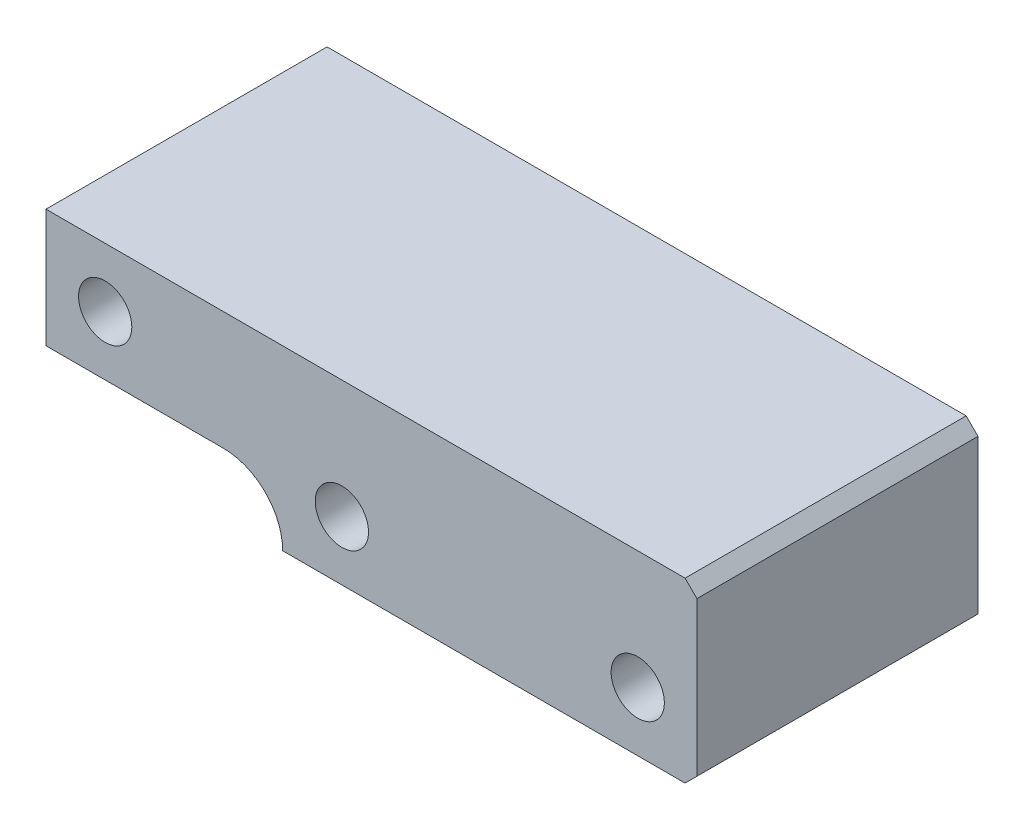
ISO-10303-21;
HEADER;
FILE_DESCRIPTION(('STEP AP214'),'2;1');
FILE_NAME('part.step','',(''),(''),'','','');
FILE_SCHEMA(('AUTOMOTIVE_DESIGN { 1 0 10303 214 1 1 1 1 }'));
ENDSEC;
DATA;
#1=APPLICATION_CONTEXT('core data for automotive mechanical design processes');
#2=APPLICATION_PROTOCOL_DEFINITION('international standard','automotive_design',2000,#1);
#3=PRODUCT_CONTEXT('',#1,'mechanical');
#4=PRODUCT('Part','Part','',(#3));
#5=PRODUCT_RELATED_PRODUCT_CATEGORY('part','',(#4));
#6=PRODUCT_DEFINITION_FORMATION('','',#4);
#7=PRODUCT_DEFINITION_CONTEXT('part definition',#1,'design');
#8=PRODUCT_DEFINITION('design','',#6,#7);
#9=PRODUCT_DEFINITION_SHAPE('','',#8);
#10=(LENGTH_UNIT() NAMED_UNIT(*) SI_UNIT(.MILLI.,.METRE.));
#11=(NAMED_UNIT(*) PLANE_ANGLE_UNIT() SI_UNIT($,.RADIAN.));
#12=(NAMED_UNIT(*) SI_UNIT($,.STERADIAN.) SOLID_ANGLE_UNIT());
#13=UNCERTAINTY_MEASURE_WITH_UNIT(LENGTH_MEASURE(1.E-05),#10,'distance_accuracy_value','');
#14=(GEOMETRIC_REPRESENTATION_CONTEXT(3) GLOBAL_UNCERTAINTY_ASSIGNED_CONTEXT((#13)) GLOBAL_UNIT_ASSIGNED_CONTEXT((#10,
#11,#12)) REPRESENTATION_CONTEXT('',''));
#15=CARTESIAN_POINT('',(0.,0.,0.));
#16=DIRECTION('',(0.,0.,1.));
#17=DIRECTION('',(1.,0.,0.));
#18=AXIS2_PLACEMENT_3D('',#15,#16,#17);
#19=CARTESIAN_POINT('',(0.,0.,47.5));
#20=DIRECTION('',(0.,0.,1.));
#21=DIRECTION('',(1.,0.,0.));
#22=AXIS2_PLACEMENT_3D('',#19,#20,#21);
#23=PLANE('',#22);
#24=CARTESIAN_POINT('',(25.,0.,47.5));
#25=DIRECTION('',(0.,0.,1.));
#26=DIRECTION('',(1.,0.,0.));
#27=AXIS2_PLACEMENT_3D('',#24,#25,#26);
#28=CIRCLE('',#27,4.5);
#29=CARTESIAN_POINT('',(29.5,0.,47.5));
#30=VERTEX_POINT('',#29);
#31=EDGE_CURVE('E236',#30,#30,#28,.T.);
#32=ORIENTED_EDGE('',*,*,#31,.F.);
#33=EDGE_LOOP('',(#32));
#34=FACE_BOUND('',#33,.T.);
#35=DIRECTION('',(1.,0.,0.));
#36=VECTOR('',#35,1.);
#37=CARTESIAN_POINT('',(-35.,-10.,47.5));
#38=LINE('',#37,#36);
#39=CARTESIAN_POINT('',(-35.,-10.,47.5));
#40=VERTEX_POINT('',#39);
#41=CARTESIAN_POINT('',(33.,-10.,47.5));
#42=VERTEX_POINT('',#41);
#43=EDGE_CURVE('E134',#40,#42,#38,.T.);
#44=ORIENTED_EDGE('',*,*,#43,.T.);
#45=DIRECTION('',(-0.707106781186548,-0.707106781186548,0.));
#46=VECTOR('',#45,1.);
#47=CARTESIAN_POINT('',(21.5,-21.5,47.5));
#48=LINE('',#47,#46);
#49=CARTESIAN_POINT('',(35.,-8.,47.5));
#50=VERTEX_POINT('',#49);
#51=EDGE_CURVE('E51',#42,#50,#48,.F.);
#52=ORIENTED_EDGE('',*,*,#51,.T.);
#53=DIRECTION('',(0.,1.,0.));
#54=VECTOR('',#53,1.);
#55=CARTESIAN_POINT('',(35.,10.,47.5));
#56=LINE('',#55,#54);
#57=CARTESIAN_POINT('',(35.,18.,47.5));
#58=VERTEX_POINT('',#57);
#59=EDGE_CURVE('E117',#50,#58,#56,.T.);
#60=ORIENTED_EDGE('',*,*,#59,.T.);
#61=DIRECTION('',(0.707106781186549,-0.707106781186546,0.));
#62=VECTOR('',#61,1.);
#63=CARTESIAN_POINT('',(26.4999999999999,26.5,47.5));
#64=LINE('',#63,#62);
#65=CARTESIAN_POINT('',(33.,20.,47.5));
#66=VERTEX_POINT('',#65);
#67=EDGE_CURVE('E58',#58,#66,#64,.F.);
#68=ORIENTED_EDGE('',*,*,#67,.T.);
#69=DIRECTION('',(-1.,0.,0.));
#70=VECTOR('',#69,1.);
#71=CARTESIAN_POINT('',(35.,20.,47.5));
#72=LINE('',#71,#70);
#73=CARTESIAN_POINT('',(-75.,20.,47.5));
#74=VERTEX_POINT('',#73);
#75=EDGE_CURVE('E108',#66,#74,#72,.T.);
#76=ORIENTED_EDGE('',*,*,#75,.T.);
#77=DIRECTION('',(0.,-1.,0.));
#78=VECTOR('',#77,1.);
#79=CARTESIAN_POINT('',(-75.,20.,47.5));
#80=LINE('',#79,#78);
#81=CARTESIAN_POINT('',(-75.,0.,47.5));
#82=VERTEX_POINT('',#81);
#83=EDGE_CURVE('E113',#74,#82,#80,.T.);
#84=ORIENTED_EDGE('',*,*,#83,.T.);
#85=DIRECTION('',(1.,0.,0.));
#86=VECTOR('',#85,1.);
#87=CARTESIAN_POINT('',(-75.,0.,47.5));
#88=LINE('',#87,#86);
#89=CARTESIAN_POINT('',(-45.,0.,47.5));
#90=VERTEX_POINT('',#89);
#91=EDGE_CURVE('E132',#82,#90,#88,.T.);
#92=ORIENTED_EDGE('',*,*,#91,.T.);
#93=CARTESIAN_POINT('',(-45.,-10.,47.5));
#94=DIRECTION('',(0.,0.,1.));
#95=DIRECTION('',(1.,0.,0.));
#96=AXIS2_PLACEMENT_3D('',#93,#94,#95);
#97=CIRCLE('',#96,10.);
#98=EDGE_CURVE('E158',#90,#40,#97,.F.);
#99=ORIENTED_EDGE('',*,*,#98,.T.);
#100=EDGE_LOOP('',(#44,#52,#60,#68,#76,#84,#92,#99));
#101=FACE_BOUND('',#100,.T.);
#102=CARTESIAN_POINT('',(-25.,0.,47.5));
#103=DIRECTION('',(0.,0.,1.));
#104=DIRECTION('',(1.,0.,0.));
#105=AXIS2_PLACEMENT_3D('',#102,#103,#104);
#106=CIRCLE('',#105,4.5);
#107=CARTESIAN_POINT('',(-20.5,0.,47.5));
#108=VERTEX_POINT('',#107);
#109=EDGE_CURVE('E143',#108,#108,#106,.T.);
#110=ORIENTED_EDGE('',*,*,#109,.F.);
#111=EDGE_LOOP('',(#110));
#112=FACE_BOUND('',#111,.T.);
#113=CARTESIAN_POINT('',(-65.,9.99999999999998,47.5));
#114=DIRECTION('',(0.,0.,1.));
#115=DIRECTION('',(1.,0.,0.));
#116=AXIS2_PLACEMENT_3D('',#113,#114,#115);
#117=CIRCLE('',#116,4.5);
#118=CARTESIAN_POINT('',(-60.5,9.99999999999998,47.5));
#119=VERTEX_POINT('',#118);
#120=EDGE_CURVE('E227',#119,#119,#117,.T.);
#121=ORIENTED_EDGE('',*,*,#120,.F.);
#122=EDGE_LOOP('',(#121));
#123=FACE_BOUND('',#122,.T.);
#124=ADVANCED_FACE('F42',(#34,#101,#112,#123),#23,.T.);
#125=CARTESIAN_POINT('',(0.,0.,0.));
#126=DIRECTION('',(0.,0.,1.));
#127=DIRECTION('',(1.,0.,0.));
#128=AXIS2_PLACEMENT_3D('',#125,#126,#127);
#129=PLANE('',#128);
#130=DIRECTION('',(0.,1.,0.));
#131=VECTOR('',#130,1.);
#132=CARTESIAN_POINT('',(35.,10.,0.));
#133=LINE('',#132,#131);
#134=CARTESIAN_POINT('',(35.,-8.,0.));
#135=VERTEX_POINT('',#134);
#136=CARTESIAN_POINT('',(35.,18.,0.));
#137=VERTEX_POINT('',#136);
#138=EDGE_CURVE('E140',#135,#137,#133,.T.);
#139=ORIENTED_EDGE('',*,*,#138,.F.);
#140=DIRECTION('',(0.707106781186548,0.707106781186548,0.));
#141=VECTOR('',#140,1.);
#142=CARTESIAN_POINT('',(35.,-8.,0.));
#143=LINE('',#142,#141);
#144=CARTESIAN_POINT('',(33.,-10.,0.));
#145=VERTEX_POINT('',#144);
#146=EDGE_CURVE('E167',#135,#145,#143,.F.);
#147=ORIENTED_EDGE('',*,*,#146,.T.);
#148=DIRECTION('',(1.,0.,0.));
#149=VECTOR('',#148,1.);
#150=CARTESIAN_POINT('',(-35.,-10.,0.));
#151=LINE('',#150,#149);
#152=CARTESIAN_POINT('',(-35.,-10.,0.));
#153=VERTEX_POINT('',#152);
#154=EDGE_CURVE('E150',#153,#145,#151,.T.);
#155=ORIENTED_EDGE('',*,*,#154,.F.);
#156=CARTESIAN_POINT('',(-45.,-10.,0.));
#157=DIRECTION('',(0.,0.,1.));
#158=DIRECTION('',(1.,0.,0.));
#159=AXIS2_PLACEMENT_3D('',#156,#157,#158);
#160=CIRCLE('',#159,10.);
#161=CARTESIAN_POINT('',(-45.,0.,0.));
#162=VERTEX_POINT('',#161);
#163=EDGE_CURVE('E156',#153,#162,#160,.T.);
#164=ORIENTED_EDGE('',*,*,#163,.T.);
#165=DIRECTION('',(1.,0.,0.));
#166=VECTOR('',#165,1.);
#167=CARTESIAN_POINT('',(-75.,0.,0.));
#168=LINE('',#167,#166);
#169=CARTESIAN_POINT('',(-75.,0.,0.));
#170=VERTEX_POINT('',#169);
#171=EDGE_CURVE('E147',#170,#162,#168,.T.);
#172=ORIENTED_EDGE('',*,*,#171,.F.);
#173=DIRECTION('',(0.,-1.,0.));
#174=VECTOR('',#173,1.);
#175=CARTESIAN_POINT('',(-75.,20.,0.));
#176=LINE('',#175,#174);
#177=CARTESIAN_POINT('',(-75.,20.,0.));
#178=VERTEX_POINT('',#177);
#179=EDGE_CURVE('E145',#178,#170,#176,.T.);
#180=ORIENTED_EDGE('',*,*,#179,.F.);
#181=DIRECTION('',(-1.,0.,0.));
#182=VECTOR('',#181,1.);
#183=CARTESIAN_POINT('',(-65.,20.,0.));
#184=LINE('',#183,#182);
#185=CARTESIAN_POINT('',(33.,20.,0.));
#186=VERTEX_POINT('',#185);
#187=EDGE_CURVE('E123',#186,#178,#184,.T.);
#188=ORIENTED_EDGE('',*,*,#187,.F.);
#189=DIRECTION('',(-0.707106781186549,0.707106781186546,0.));
#190=VECTOR('',#189,1.);
#191=CARTESIAN_POINT('',(33.,20.,0.));
#192=LINE('',#191,#190);
#193=EDGE_CURVE('E165',#186,#137,#192,.F.);
#194=ORIENTED_EDGE('',*,*,#193,.T.);
#195=EDGE_LOOP('',(#139,#147,#155,#164,#172,#180,#188,#194));
#196=FACE_BOUND('',#195,.T.);
#197=CARTESIAN_POINT('',(-25.,0.,0.));
#198=DIRECTION('',(0.,0.,1.));
#199=DIRECTION('',(1.,0.,0.));
#200=AXIS2_PLACEMENT_3D('',#197,#198,#199);
#201=CIRCLE('',#200,4.5);
#202=CARTESIAN_POINT('',(-20.5,0.,0.));
#203=VERTEX_POINT('',#202);
#204=EDGE_CURVE('E239',#203,#203,#201,.T.);
#205=ORIENTED_EDGE('',*,*,#204,.T.);
#206=EDGE_LOOP('',(#205));
#207=FACE_BOUND('',#206,.T.);
#208=CARTESIAN_POINT('',(25.,0.,0.));
#209=DIRECTION('',(0.,0.,1.));
#210=DIRECTION('',(1.,0.,0.));
#211=AXIS2_PLACEMENT_3D('',#208,#209,#210);
#212=CIRCLE('',#211,4.5);
#213=CARTESIAN_POINT('',(29.5,0.,0.));
#214=VERTEX_POINT('',#213);
#215=EDGE_CURVE('E233',#214,#214,#212,.T.);
#216=ORIENTED_EDGE('',*,*,#215,.T.);
#217=EDGE_LOOP('',(#216));
#218=FACE_BOUND('',#217,.T.);
#219=CARTESIAN_POINT('',(-65.,9.99999999999998,0.));
#220=DIRECTION('',(0.,0.,1.));
#221=DIRECTION('',(1.,0.,0.));
#222=AXIS2_PLACEMENT_3D('',#219,#220,#221);
#223=CIRCLE('',#222,4.5);
#224=CARTESIAN_POINT('',(-60.5,9.99999999999998,0.));
#225=VERTEX_POINT('',#224);
#226=EDGE_CURVE('E230',#225,#225,#223,.T.);
#227=ORIENTED_EDGE('',*,*,#226,.T.);
#228=EDGE_LOOP('',(#227));
#229=FACE_BOUND('',#228,.T.);
#230=ADVANCED_FACE('F181',(#196,#207,#218,#229),#129,.F.);
#231=CARTESIAN_POINT('',(35.,10.,47.5));
#232=DIRECTION('',(-1.,0.,0.));
#233=DIRECTION('',(0.,0.,1.));
#234=AXIS2_PLACEMENT_3D('',#231,#232,#233);
#235=PLANE('',#234);
#236=ORIENTED_EDGE('',*,*,#59,.F.);
#237=DIRECTION('',(0.,0.,-1.));
#238=VECTOR('',#237,1.);
#239=CARTESIAN_POINT('',(35.,-8.,47.5));
#240=LINE('',#239,#238);
#241=EDGE_CURVE('E162',#50,#135,#240,.T.);
#242=ORIENTED_EDGE('',*,*,#241,.T.);
#243=ORIENTED_EDGE('',*,*,#138,.T.);
#244=DIRECTION('',(0.,0.,1.));
#245=VECTOR('',#244,1.);
#246=CARTESIAN_POINT('',(35.,18.,47.5));
#247=LINE('',#246,#245);
#248=EDGE_CURVE('E160',#137,#58,#247,.T.);
#249=ORIENTED_EDGE('',*,*,#248,.T.);
#250=EDGE_LOOP('',(#236,#242,#243,#249));
#251=FACE_BOUND('',#250,.T.);
#252=ADVANCED_FACE('F175',(#251),#235,.F.);
#253=CARTESIAN_POINT('',(-65.,20.,47.5));
#254=DIRECTION('',(0.,-1.,0.));
#255=DIRECTION('',(0.,0.,-1.));
#256=AXIS2_PLACEMENT_3D('',#253,#254,#255);
#257=PLANE('',#256);
#258=ORIENTED_EDGE('',*,*,#75,.F.);
#259=DIRECTION('',(0.,0.,-1.));
#260=VECTOR('',#259,1.);
#261=CARTESIAN_POINT('',(33.,20.,47.5));
#262=LINE('',#261,#260);
#263=EDGE_CURVE('E11',#66,#186,#262,.T.);
#264=ORIENTED_EDGE('',*,*,#263,.T.);
#265=ORIENTED_EDGE('',*,*,#187,.T.);
#266=DIRECTION('',(0.,0.,-1.));
#267=VECTOR('',#266,1.);
#268=CARTESIAN_POINT('',(-75.,20.,47.5));
#269=LINE('',#268,#267);
#270=EDGE_CURVE('E120',#74,#178,#269,.T.);
#271=ORIENTED_EDGE('',*,*,#270,.F.);
#272=EDGE_LOOP('',(#258,#264,#265,#271));
#273=FACE_BOUND('',#272,.T.);
#274=ADVANCED_FACE('F121',(#273),#257,.F.);
#275=CARTESIAN_POINT('',(-75.,20.,47.5));
#276=DIRECTION('',(1.,0.,0.));
#277=DIRECTION('',(0.,0.,-1.));
#278=AXIS2_PLACEMENT_3D('',#275,#276,#277);
#279=PLANE('',#278);
#280=ORIENTED_EDGE('',*,*,#179,.T.);
#281=DIRECTION('',(0.,0.,-1.));
#282=VECTOR('',#281,1.);
#283=CARTESIAN_POINT('',(-75.,0.,47.5));
#284=LINE('',#283,#282);
#285=EDGE_CURVE('E127',#82,#170,#284,.T.);
#286=ORIENTED_EDGE('',*,*,#285,.F.);
#287=ORIENTED_EDGE('',*,*,#83,.F.);
#288=ORIENTED_EDGE('',*,*,#270,.T.);
#289=EDGE_LOOP('',(#280,#286,#287,#288));
#290=FACE_BOUND('',#289,.T.);
#291=ADVANCED_FACE('F129',(#290),#279,.F.);
#292=CARTESIAN_POINT('',(-75.,0.,47.5));
#293=DIRECTION('',(0.,1.,0.));
#294=DIRECTION('',(0.,0.,1.));
#295=AXIS2_PLACEMENT_3D('',#292,#293,#294);
#296=PLANE('',#295);
#297=ORIENTED_EDGE('',*,*,#171,.T.);
#298=DIRECTION('',(0.,0.,-1.));
#299=VECTOR('',#298,1.);
#300=CARTESIAN_POINT('',(-45.,0.,47.5));
#301=LINE('',#300,#299);
#302=EDGE_CURVE('E126',#162,#90,#301,.F.);
#303=ORIENTED_EDGE('',*,*,#302,.T.);
#304=ORIENTED_EDGE('',*,*,#91,.F.);
#305=ORIENTED_EDGE('',*,*,#285,.T.);
#306=EDGE_LOOP('',(#297,#303,#304,#305));
#307=FACE_BOUND('',#306,.T.);
#308=ADVANCED_FACE('F191',(#307),#296,.F.);
#309=CARTESIAN_POINT('',(-35.,-10.,47.5));
#310=DIRECTION('',(0.,1.,0.));
#311=DIRECTION('',(0.,0.,1.));
#312=AXIS2_PLACEMENT_3D('',#309,#310,#311);
#313=PLANE('',#312);
#314=ORIENTED_EDGE('',*,*,#154,.T.);
#315=DIRECTION('',(0.,0.,1.));
#316=VECTOR('',#315,1.);
#317=CARTESIAN_POINT('',(33.,-10.,47.5));
#318=LINE('',#317,#316);
#319=EDGE_CURVE('E66',#145,#42,#318,.T.);
#320=ORIENTED_EDGE('',*,*,#319,.T.);
#321=ORIENTED_EDGE('',*,*,#43,.F.);
#322=DIRECTION('',(0.,0.,-1.));
#323=VECTOR('',#322,1.);
#324=CARTESIAN_POINT('',(-35.,-10.,47.5));
#325=LINE('',#324,#323);
#326=EDGE_CURVE('E139',#40,#153,#325,.T.);
#327=ORIENTED_EDGE('',*,*,#326,.T.);
#328=EDGE_LOOP('',(#314,#320,#321,#327));
#329=FACE_BOUND('',#328,.T.);
#330=ADVANCED_FACE('F183',(#329),#313,.F.);
#331=CARTESIAN_POINT('',(-25.,0.,47.5));
#332=DIRECTION('',(0.,0.,-1.));
#333=DIRECTION('',(-1.,0.,0.));
#334=AXIS2_PLACEMENT_3D('',#331,#332,#333);
#335=CYLINDRICAL_SURFACE('',#334,4.5);
#336=ORIENTED_EDGE('',*,*,#109,.T.);
#337=EDGE_LOOP('',(#336));
#338=FACE_BOUND('',#337,.T.);
#339=ORIENTED_EDGE('',*,*,#204,.F.);
#340=EDGE_LOOP('',(#339));
#341=FACE_BOUND('',#340,.T.);
#342=ADVANCED_FACE('F198',(#338,#341),#335,.F.);
#343=CARTESIAN_POINT('',(25.,0.,47.5));
#344=DIRECTION('',(0.,0.,-1.));
#345=DIRECTION('',(-1.,0.,0.));
#346=AXIS2_PLACEMENT_3D('',#343,#344,#345);
#347=CYLINDRICAL_SURFACE('',#346,4.5);
#348=ORIENTED_EDGE('',*,*,#31,.T.);
#349=EDGE_LOOP('',(#348));
#350=FACE_BOUND('',#349,.T.);
#351=ORIENTED_EDGE('',*,*,#215,.F.);
#352=EDGE_LOOP('',(#351));
#353=FACE_BOUND('',#352,.T.);
#354=ADVANCED_FACE('F212',(#350,#353),#347,.F.);
#355=CARTESIAN_POINT('',(-65.,9.99999999999998,47.5));
#356=DIRECTION('',(0.,0.,-1.));
#357=DIRECTION('',(-1.,0.,0.));
#358=AXIS2_PLACEMENT_3D('',#355,#356,#357);
#359=CYLINDRICAL_SURFACE('',#358,4.5);
#360=ORIENTED_EDGE('',*,*,#120,.T.);
#361=EDGE_LOOP('',(#360));
#362=FACE_BOUND('',#361,.T.);
#363=ORIENTED_EDGE('',*,*,#226,.F.);
#364=EDGE_LOOP('',(#363));
#365=FACE_BOUND('',#364,.T.);
#366=ADVANCED_FACE('F216',(#362,#365),#359,.F.);
#367=CARTESIAN_POINT('',(-45.,-10.,47.5));
#368=DIRECTION('',(0.,0.,1.));
#369=DIRECTION('',(1.,0.,0.));
#370=AXIS2_PLACEMENT_3D('',#367,#368,#369);
#371=CYLINDRICAL_SURFACE('',#370,10.);
#372=ORIENTED_EDGE('',*,*,#98,.F.);
#373=ORIENTED_EDGE('',*,*,#302,.F.);
#374=ORIENTED_EDGE('',*,*,#163,.F.);
#375=ORIENTED_EDGE('',*,*,#326,.F.);
#376=EDGE_LOOP('',(#372,#373,#374,#375));
#377=FACE_BOUND('',#376,.T.);
#378=ADVANCED_FACE('F187',(#377),#371,.F.);
#379=CARTESIAN_POINT('',(35.,-8.,47.5));
#380=DIRECTION('',(-0.707106781186547,0.707106781186547,0.));
#381=DIRECTION('',(0.,0.,-1.));
#382=AXIS2_PLACEMENT_3D('',#379,#380,#381);
#383=PLANE('',#382);
#384=ORIENTED_EDGE('',*,*,#51,.F.);
#385=ORIENTED_EDGE('',*,*,#319,.F.);
#386=ORIENTED_EDGE('',*,*,#146,.F.);
#387=ORIENTED_EDGE('',*,*,#241,.F.);
#388=EDGE_LOOP('',(#384,#385,#386,#387));
#389=FACE_BOUND('',#388,.T.);
#390=ADVANCED_FACE('F178',(#389),#383,.F.);
#391=CARTESIAN_POINT('',(33.,20.,47.5));
#392=DIRECTION('',(-0.707106781186546,-0.707106781186549,0.));
#393=DIRECTION('',(0.,0.,-1.));
#394=AXIS2_PLACEMENT_3D('',#391,#392,#393);
#395=PLANE('',#394);
#396=ORIENTED_EDGE('',*,*,#67,.F.);
#397=ORIENTED_EDGE('',*,*,#248,.F.);
#398=ORIENTED_EDGE('',*,*,#193,.F.);
#399=ORIENTED_EDGE('',*,*,#263,.F.);
#400=EDGE_LOOP('',(#396,#397,#398,#399));
#401=FACE_BOUND('',#400,.T.);
#402=ADVANCED_FACE('F45',(#401),#395,.F.);
#403=CLOSED_SHELL('',(#124,#230,#252,#274,#291,#308,#330,#342,#354,#366,#378,#390,#402));
#404=MANIFOLD_SOLID_BREP('B2',#403);
#405=ADVANCED_BREP_SHAPE_REPRESENTATION('',(#18,#404),#14);
#406=SHAPE_DEFINITION_REPRESENTATION(#9,#405);
ENDSEC;
END-ISO-10303-21;
